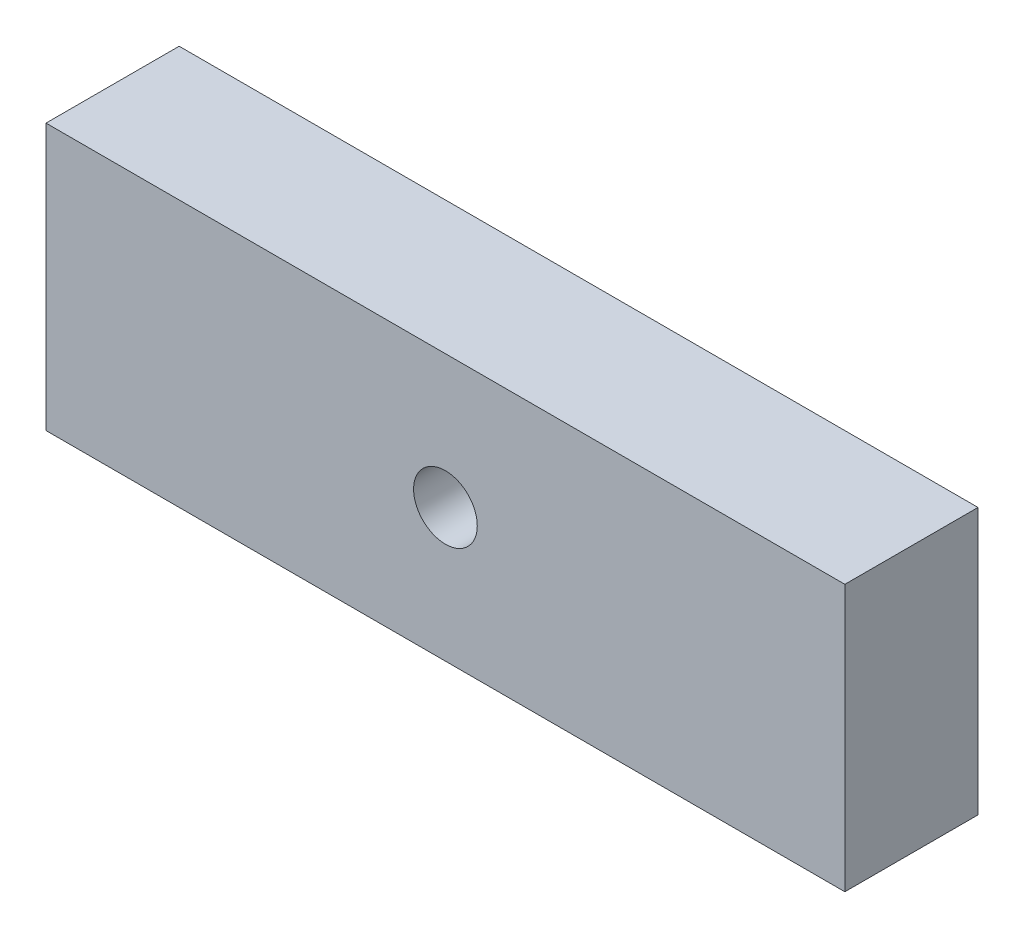
ISO-10303-21;
HEADER;
FILE_DESCRIPTION(('STEP AP214'),'2;1');
FILE_NAME('part.step','',(''),(''),'','','');
FILE_SCHEMA(('AUTOMOTIVE_DESIGN { 1 0 10303 214 1 1 1 1 }'));
ENDSEC;
DATA;
#1=APPLICATION_CONTEXT('core data for automotive mechanical design processes');
#2=APPLICATION_PROTOCOL_DEFINITION('international standard','automotive_design',2000,#1);
#3=PRODUCT_CONTEXT('',#1,'mechanical');
#4=PRODUCT('Part','Part','',(#3));
#5=PRODUCT_RELATED_PRODUCT_CATEGORY('part','',(#4));
#6=PRODUCT_DEFINITION_FORMATION('','',#4);
#7=PRODUCT_DEFINITION_CONTEXT('part definition',#1,'design');
#8=PRODUCT_DEFINITION('design','',#6,#7);
#9=PRODUCT_DEFINITION_SHAPE('','',#8);
#10=(LENGTH_UNIT() NAMED_UNIT(*) SI_UNIT(.MILLI.,.METRE.));
#11=(NAMED_UNIT(*) PLANE_ANGLE_UNIT() SI_UNIT($,.RADIAN.));
#12=(NAMED_UNIT(*) SI_UNIT($,.STERADIAN.) SOLID_ANGLE_UNIT());
#13=UNCERTAINTY_MEASURE_WITH_UNIT(LENGTH_MEASURE(1.E-05),#10,'distance_accuracy_value','');
#14=(GEOMETRIC_REPRESENTATION_CONTEXT(3) GLOBAL_UNCERTAINTY_ASSIGNED_CONTEXT((#13)) GLOBAL_UNIT_ASSIGNED_CONTEXT((#10,
#11,#12)) REPRESENTATION_CONTEXT('',''));
#15=CARTESIAN_POINT('',(0.,0.,0.));
#16=DIRECTION('',(0.,0.,1.));
#17=DIRECTION('',(1.,0.,0.));
#18=AXIS2_PLACEMENT_3D('',#15,#16,#17);
#19=CARTESIAN_POINT('',(0.,0.,7.9375));
#20=DIRECTION('',(1.,0.,0.));
#21=DIRECTION('',(0.,0.,-1.));
#22=AXIS2_PLACEMENT_3D('',#19,#20,#21);
#23=PLANE('',#22);
#24=DIRECTION('',(0.,-1.,0.));
#25=VECTOR('',#24,1.);
#26=CARTESIAN_POINT('',(0.,0.,0.));
#27=LINE('',#26,#25);
#28=CARTESIAN_POINT('',(0.,15.875,0.));
#29=VERTEX_POINT('',#28);
#30=CARTESIAN_POINT('',(0.,0.,0.));
#31=VERTEX_POINT('',#30);
#32=EDGE_CURVE('E97',#29,#31,#27,.T.);
#33=ORIENTED_EDGE('',*,*,#32,.T.);
#34=DIRECTION('',(0.,0.,-1.));
#35=VECTOR('',#34,1.);
#36=CARTESIAN_POINT('',(0.,0.,7.9375));
#37=LINE('',#36,#35);
#38=CARTESIAN_POINT('',(0.,0.,7.9375));
#39=VERTEX_POINT('',#38);
#40=EDGE_CURVE('E11',#39,#31,#37,.T.);
#41=ORIENTED_EDGE('',*,*,#40,.F.);
#42=DIRECTION('',(0.,-1.,0.));
#43=VECTOR('',#42,1.);
#44=CARTESIAN_POINT('',(0.,0.,7.9375));
#45=LINE('',#44,#43);
#46=CARTESIAN_POINT('',(0.,15.875,7.9375));
#47=VERTEX_POINT('',#46);
#48=EDGE_CURVE('E85',#47,#39,#45,.T.);
#49=ORIENTED_EDGE('',*,*,#48,.F.);
#50=DIRECTION('',(0.,0.,-1.));
#51=VECTOR('',#50,1.);
#52=CARTESIAN_POINT('',(0.,15.875,7.9375));
#53=LINE('',#52,#51);
#54=EDGE_CURVE('E93',#47,#29,#53,.T.);
#55=ORIENTED_EDGE('',*,*,#54,.T.);
#56=EDGE_LOOP('',(#33,#41,#49,#55));
#57=FACE_BOUND('',#56,.T.);
#58=ADVANCED_FACE('F34',(#57),#23,.F.);
#59=CARTESIAN_POINT('',(0.,0.,7.9375));
#60=DIRECTION('',(0.,1.,0.));
#61=DIRECTION('',(0.,0.,1.));
#62=AXIS2_PLACEMENT_3D('',#59,#60,#61);
#63=PLANE('',#62);
#64=DIRECTION('',(1.,0.,0.));
#65=VECTOR('',#64,1.);
#66=CARTESIAN_POINT('',(0.,0.,0.));
#67=LINE('',#66,#65);
#68=CARTESIAN_POINT('',(47.625,0.,0.));
#69=VERTEX_POINT('',#68);
#70=EDGE_CURVE('E89',#31,#69,#67,.T.);
#71=ORIENTED_EDGE('',*,*,#70,.T.);
#72=DIRECTION('',(0.,0.,-1.));
#73=VECTOR('',#72,1.);
#74=CARTESIAN_POINT('',(47.625,0.,7.9375));
#75=LINE('',#74,#73);
#76=CARTESIAN_POINT('',(47.625,0.,7.9375));
#77=VERTEX_POINT('',#76);
#78=EDGE_CURVE('E42',#77,#69,#75,.T.);
#79=ORIENTED_EDGE('',*,*,#78,.F.);
#80=DIRECTION('',(1.,0.,0.));
#81=VECTOR('',#80,1.);
#82=CARTESIAN_POINT('',(0.,0.,7.9375));
#83=LINE('',#82,#81);
#84=EDGE_CURVE('E80',#39,#77,#83,.T.);
#85=ORIENTED_EDGE('',*,*,#84,.F.);
#86=ORIENTED_EDGE('',*,*,#40,.T.);
#87=EDGE_LOOP('',(#71,#79,#85,#86));
#88=FACE_BOUND('',#87,.T.);
#89=ADVANCED_FACE('F88',(#88),#63,.F.);
#90=CARTESIAN_POINT('',(47.625,0.,7.9375));
#91=DIRECTION('',(-1.,0.,0.));
#92=DIRECTION('',(0.,0.,1.));
#93=AXIS2_PLACEMENT_3D('',#90,#91,#92);
#94=PLANE('',#93);
#95=DIRECTION('',(0.,1.,0.));
#96=VECTOR('',#95,1.);
#97=CARTESIAN_POINT('',(47.625,0.,0.));
#98=LINE('',#97,#96);
#99=CARTESIAN_POINT('',(47.625,15.875,0.));
#100=VERTEX_POINT('',#99);
#101=EDGE_CURVE('E67',#69,#100,#98,.T.);
#102=ORIENTED_EDGE('',*,*,#101,.T.);
#103=DIRECTION('',(0.,0.,-1.));
#104=VECTOR('',#103,1.);
#105=CARTESIAN_POINT('',(47.625,15.875,7.9375));
#106=LINE('',#105,#104);
#107=CARTESIAN_POINT('',(47.625,15.875,7.9375));
#108=VERTEX_POINT('',#107);
#109=EDGE_CURVE('E90',#108,#100,#106,.T.);
#110=ORIENTED_EDGE('',*,*,#109,.F.);
#111=DIRECTION('',(0.,1.,0.));
#112=VECTOR('',#111,1.);
#113=CARTESIAN_POINT('',(47.625,0.,7.9375));
#114=LINE('',#113,#112);
#115=EDGE_CURVE('E83',#77,#108,#114,.T.);
#116=ORIENTED_EDGE('',*,*,#115,.F.);
#117=ORIENTED_EDGE('',*,*,#78,.T.);
#118=EDGE_LOOP('',(#102,#110,#116,#117));
#119=FACE_BOUND('',#118,.T.);
#120=ADVANCED_FACE('F91',(#119),#94,.F.);
#121=CARTESIAN_POINT('',(0.,15.875,7.9375));
#122=DIRECTION('',(0.,-1.,0.));
#123=DIRECTION('',(0.,0.,-1.));
#124=AXIS2_PLACEMENT_3D('',#121,#122,#123);
#125=PLANE('',#124);
#126=DIRECTION('',(-1.,0.,0.));
#127=VECTOR('',#126,1.);
#128=CARTESIAN_POINT('',(0.,15.875,0.));
#129=LINE('',#128,#127);
#130=EDGE_CURVE('E73',#100,#29,#129,.T.);
#131=ORIENTED_EDGE('',*,*,#130,.T.);
#132=ORIENTED_EDGE('',*,*,#54,.F.);
#133=DIRECTION('',(-1.,0.,0.));
#134=VECTOR('',#133,1.);
#135=CARTESIAN_POINT('',(0.,15.875,7.9375));
#136=LINE('',#135,#134);
#137=EDGE_CURVE('E50',#108,#47,#136,.T.);
#138=ORIENTED_EDGE('',*,*,#137,.F.);
#139=ORIENTED_EDGE('',*,*,#109,.T.);
#140=EDGE_LOOP('',(#131,#132,#138,#139));
#141=FACE_BOUND('',#140,.T.);
#142=ADVANCED_FACE('F105',(#141),#125,.F.);
#143=CARTESIAN_POINT('',(0.,0.,7.9375));
#144=DIRECTION('',(0.,0.,-1.));
#145=DIRECTION('',(-1.,0.,0.));
#146=AXIS2_PLACEMENT_3D('',#143,#144,#145);
#147=PLANE('',#146);
#148=CARTESIAN_POINT('',(23.8125,7.9375,7.9375));
#149=DIRECTION('',(0.,0.,1.));
#150=DIRECTION('',(1.,0.,0.));
#151=AXIS2_PLACEMENT_3D('',#148,#149,#150);
#152=CIRCLE('',#151,1.89864999999999);
#153=CARTESIAN_POINT('',(25.71115,7.9375,7.9375));
#154=VERTEX_POINT('',#153);
#155=EDGE_CURVE('E113',#154,#154,#152,.T.);
#156=ORIENTED_EDGE('',*,*,#155,.F.);
#157=EDGE_LOOP('',(#156));
#158=FACE_BOUND('',#157,.T.);
#159=ORIENTED_EDGE('',*,*,#48,.T.);
#160=ORIENTED_EDGE('',*,*,#84,.T.);
#161=ORIENTED_EDGE('',*,*,#115,.T.);
#162=ORIENTED_EDGE('',*,*,#137,.T.);
#163=EDGE_LOOP('',(#159,#160,#161,#162));
#164=FACE_BOUND('',#163,.T.);
#165=ADVANCED_FACE('F81',(#158,#164),#147,.F.);
#166=CARTESIAN_POINT('',(0.,0.,0.));
#167=DIRECTION('',(0.,0.,-1.));
#168=DIRECTION('',(-1.,0.,0.));
#169=AXIS2_PLACEMENT_3D('',#166,#167,#168);
#170=PLANE('',#169);
#171=CARTESIAN_POINT('',(23.8125,7.9375,0.));
#172=DIRECTION('',(0.,0.,-1.));
#173=DIRECTION('',(-1.,0.,0.));
#174=AXIS2_PLACEMENT_3D('',#171,#172,#173);
#175=CIRCLE('',#174,1.89864999999999);
#176=CARTESIAN_POINT('',(21.91385,7.9375,0.));
#177=VERTEX_POINT('',#176);
#178=EDGE_CURVE('E100',#177,#177,#175,.T.);
#179=ORIENTED_EDGE('',*,*,#178,.F.);
#180=EDGE_LOOP('',(#179));
#181=FACE_BOUND('',#180,.T.);
#182=ORIENTED_EDGE('',*,*,#32,.F.);
#183=ORIENTED_EDGE('',*,*,#130,.F.);
#184=ORIENTED_EDGE('',*,*,#101,.F.);
#185=ORIENTED_EDGE('',*,*,#70,.F.);
#186=EDGE_LOOP('',(#182,#183,#184,#185));
#187=FACE_BOUND('',#186,.T.);
#188=ADVANCED_FACE('F108',(#181,#187),#170,.T.);
#189=CARTESIAN_POINT('',(23.8125,7.9375,7.9375));
#190=DIRECTION('',(0.,0.,1.));
#191=DIRECTION('',(1.,0.,0.));
#192=AXIS2_PLACEMENT_3D('',#189,#190,#191);
#193=CYLINDRICAL_SURFACE('',#192,1.89864999999999);
#194=ORIENTED_EDGE('',*,*,#155,.T.);
#195=EDGE_LOOP('',(#194));
#196=FACE_BOUND('',#195,.T.);
#197=ORIENTED_EDGE('',*,*,#178,.T.);
#198=EDGE_LOOP('',(#197));
#199=FACE_BOUND('',#198,.T.);
#200=ADVANCED_FACE('F117',(#196,#199),#193,.F.);
#201=CLOSED_SHELL('',(#58,#89,#120,#142,#165,#188,#200));
#202=MANIFOLD_SOLID_BREP('B2',#201);
#203=ADVANCED_BREP_SHAPE_REPRESENTATION('',(#18,#202),#14);
#204=SHAPE_DEFINITION_REPRESENTATION(#9,#203);
ENDSEC;
END-ISO-10303-21;
